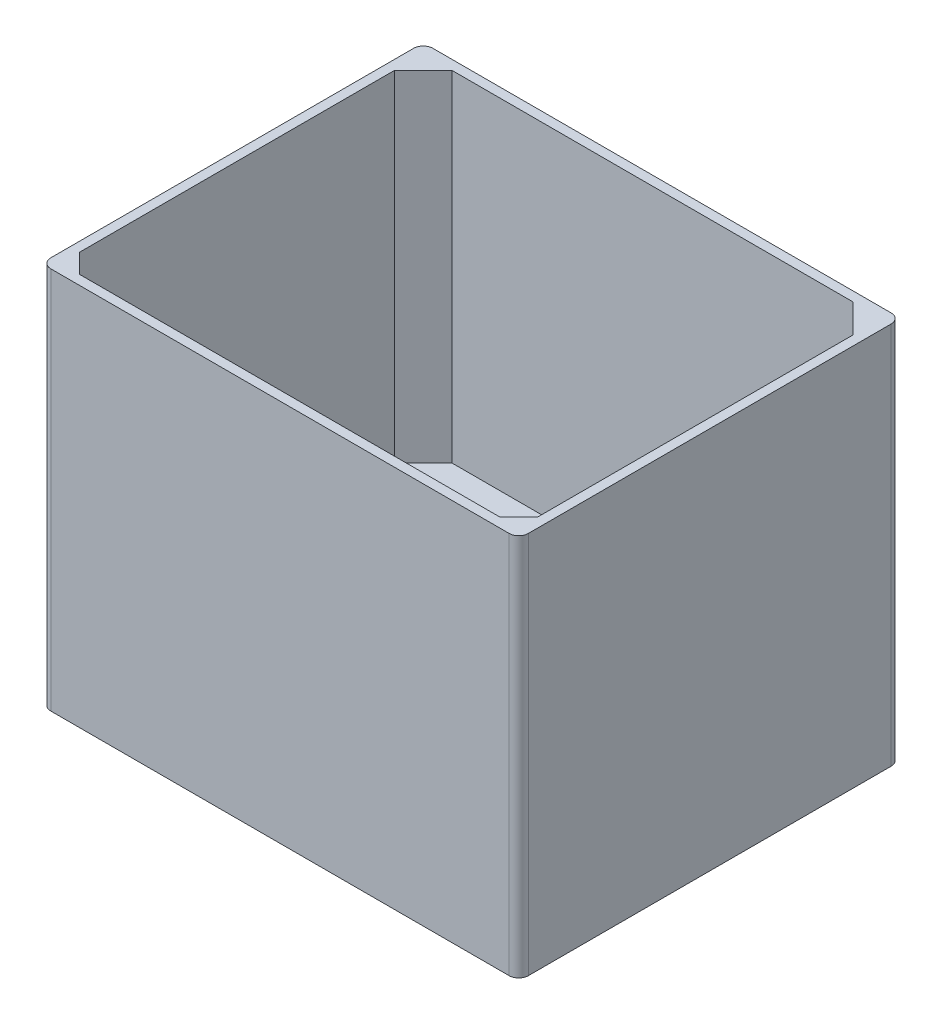
ISO-10303-21;
HEADER;
FILE_DESCRIPTION(('STEP AP214'),'2;1');
FILE_NAME('part.step','',(''),(''),'','','');
FILE_SCHEMA(('AUTOMOTIVE_DESIGN { 1 0 10303 214 1 1 1 1 }'));
ENDSEC;
DATA;
#1=APPLICATION_CONTEXT('core data for automotive mechanical design processes');
#2=APPLICATION_PROTOCOL_DEFINITION('international standard','automotive_design',2000,#1);
#3=PRODUCT_CONTEXT('',#1,'mechanical');
#4=PRODUCT('Part','Part','',(#3));
#5=PRODUCT_RELATED_PRODUCT_CATEGORY('part','',(#4));
#6=PRODUCT_DEFINITION_FORMATION('','',#4);
#7=PRODUCT_DEFINITION_CONTEXT('part definition',#1,'design');
#8=PRODUCT_DEFINITION('design','',#6,#7);
#9=PRODUCT_DEFINITION_SHAPE('','',#8);
#10=(LENGTH_UNIT() NAMED_UNIT(*) SI_UNIT(.MILLI.,.METRE.));
#11=(NAMED_UNIT(*) PLANE_ANGLE_UNIT() SI_UNIT($,.RADIAN.));
#12=(NAMED_UNIT(*) SI_UNIT($,.STERADIAN.) SOLID_ANGLE_UNIT());
#13=UNCERTAINTY_MEASURE_WITH_UNIT(LENGTH_MEASURE(1.E-05),#10,'distance_accuracy_value','');
#14=(GEOMETRIC_REPRESENTATION_CONTEXT(3) GLOBAL_UNCERTAINTY_ASSIGNED_CONTEXT((#13)) GLOBAL_UNIT_ASSIGNED_CONTEXT((#10,
#11,#12)) REPRESENTATION_CONTEXT('',''));
#15=CARTESIAN_POINT('',(0.,0.,0.));
#16=DIRECTION('',(0.,0.,1.));
#17=DIRECTION('',(1.,0.,0.));
#18=AXIS2_PLACEMENT_3D('',#15,#16,#17);
#19=CARTESIAN_POINT('',(9.07407407407408,-99.7824280830745,1.16315046698049));
#20=DIRECTION('',(0.,0.,-1.));
#21=DIRECTION('',(-1.,0.,0.));
#22=AXIS2_PLACEMENT_3D('',#19,#20,#21);
#23=PLANE('',#22);
#24=DIRECTION('',(-1.,0.,0.));
#25=VECTOR('',#24,1.);
#26=CARTESIAN_POINT('',(9.07407407407408,1.,1.16315046698049));
#27=LINE('',#26,#25);
#28=CARTESIAN_POINT('',(46.8438331280528,1.,1.16315046698049));
#29=VERTEX_POINT('',#28);
#30=CARTESIAN_POINT('',(-28.6539944588389,1.,1.16315046698049));
#31=VERTEX_POINT('',#30);
#32=EDGE_CURVE('E70',#29,#31,#27,.T.);
#33=ORIENTED_EDGE('',*,*,#32,.F.);
#34=DIRECTION('',(0.,1.,0.));
#35=VECTOR('',#34,1.);
#36=CARTESIAN_POINT('',(46.8438331280528,-99.7824280830745,1.16315046698049));
#37=LINE('',#36,#35);
#38=CARTESIAN_POINT('',(46.8438331280528,8.99999999999999,1.16315046698049));
#39=VERTEX_POINT('',#38);
#40=EDGE_CURVE('E267',#29,#39,#37,.T.);
#41=ORIENTED_EDGE('',*,*,#40,.T.);
#42=DIRECTION('',(-1.,0.,0.));
#43=VECTOR('',#42,1.);
#44=CARTESIAN_POINT('',(0.,9.,1.16315046698049));
#45=LINE('',#44,#43);
#46=CARTESIAN_POINT('',(-28.6539944588389,9.,1.16315046698049));
#47=VERTEX_POINT('',#46);
#48=EDGE_CURVE('E348',#39,#47,#45,.T.);
#49=ORIENTED_EDGE('',*,*,#48,.T.);
#50=DIRECTION('',(0.,1.,0.));
#51=VECTOR('',#50,1.);
#52=CARTESIAN_POINT('',(-28.6539944588389,-99.7824280830745,1.16315046698049));
#53=LINE('',#52,#51);
#54=EDGE_CURVE('E266',#31,#47,#53,.T.);
#55=ORIENTED_EDGE('',*,*,#54,.F.);
#56=EDGE_LOOP('',(#33,#41,#49,#55));
#57=FACE_BOUND('',#56,.T.);
#58=ADVANCED_FACE('F46',(#57),#23,.F.);
#59=CARTESIAN_POINT('',(46.8438331280528,-99.7824280830745,1.16315046698049));
#60=DIRECTION('',(1.,0.,0.));
#61=DIRECTION('',(0.,0.,-1.));
#62=AXIS2_PLACEMENT_3D('',#59,#60,#61);
#63=PLANE('',#62);
#64=DIRECTION('',(0.,0.,-1.));
#65=VECTOR('',#64,1.);
#66=CARTESIAN_POINT('',(46.8438331280528,1.,1.16315046698049));
#67=LINE('',#66,#65);
#68=CARTESIAN_POINT('',(46.8438331280528,1.,42.7586829855372));
#69=VERTEX_POINT('',#68);
#70=EDGE_CURVE('E261',#69,#29,#67,.T.);
#71=ORIENTED_EDGE('',*,*,#70,.F.);
#72=DIRECTION('',(0.,1.,0.));
#73=VECTOR('',#72,1.);
#74=CARTESIAN_POINT('',(46.8438331280528,-99.7824280830745,42.7586829855372));
#75=LINE('',#74,#73);
#76=CARTESIAN_POINT('',(46.8438331280528,8.99999999999999,42.7586829855372));
#77=VERTEX_POINT('',#76);
#78=EDGE_CURVE('E271',#69,#77,#75,.T.);
#79=ORIENTED_EDGE('',*,*,#78,.T.);
#80=DIRECTION('',(0.,0.,-1.));
#81=VECTOR('',#80,1.);
#82=CARTESIAN_POINT('',(46.8438331280528,9.,0.));
#83=LINE('',#82,#81);
#84=EDGE_CURVE('E344',#77,#39,#83,.T.);
#85=ORIENTED_EDGE('',*,*,#84,.T.);
#86=ORIENTED_EDGE('',*,*,#40,.F.);
#87=EDGE_LOOP('',(#71,#79,#85,#86));
#88=FACE_BOUND('',#87,.T.);
#89=ADVANCED_FACE('F507',(#88),#63,.F.);
#90=CARTESIAN_POINT('',(46.8438331280528,-99.7824280830745,42.7586829855372));
#91=DIRECTION('',(0.,0.,1.));
#92=DIRECTION('',(1.,0.,0.));
#93=AXIS2_PLACEMENT_3D('',#90,#91,#92);
#94=PLANE('',#93);
#95=DIRECTION('',(1.,0.,0.));
#96=VECTOR('',#95,1.);
#97=CARTESIAN_POINT('',(46.8438331280528,1.,42.7586829855372));
#98=LINE('',#97,#96);
#99=CARTESIAN_POINT('',(-28.6539944588389,1.,42.7586829855372));
#100=VERTEX_POINT('',#99);
#101=EDGE_CURVE('E253',#100,#69,#98,.T.);
#102=ORIENTED_EDGE('',*,*,#101,.F.);
#103=DIRECTION('',(0.,1.,0.));
#104=VECTOR('',#103,1.);
#105=CARTESIAN_POINT('',(-28.6539944588389,-99.7824280830745,42.7586829855372));
#106=LINE('',#105,#104);
#107=CARTESIAN_POINT('',(-28.6539944588389,8.99999999999999,42.7586829855372));
#108=VERTEX_POINT('',#107);
#109=EDGE_CURVE('E274',#100,#108,#106,.T.);
#110=ORIENTED_EDGE('',*,*,#109,.T.);
#111=DIRECTION('',(1.,0.,0.));
#112=VECTOR('',#111,1.);
#113=CARTESIAN_POINT('',(0.,9.,42.7586829855372));
#114=LINE('',#113,#112);
#115=EDGE_CURVE('E340',#108,#77,#114,.T.);
#116=ORIENTED_EDGE('',*,*,#115,.T.);
#117=ORIENTED_EDGE('',*,*,#78,.F.);
#118=EDGE_LOOP('',(#102,#110,#116,#117));
#119=FACE_BOUND('',#118,.T.);
#120=ADVANCED_FACE('F514',(#119),#94,.F.);
#121=CARTESIAN_POINT('',(-28.6539944588389,-99.7824280830745,42.7586829855372));
#122=DIRECTION('',(-1.,0.,0.));
#123=DIRECTION('',(0.,0.,1.));
#124=AXIS2_PLACEMENT_3D('',#121,#122,#123);
#125=PLANE('',#124);
#126=DIRECTION('',(0.,0.,1.));
#127=VECTOR('',#126,1.);
#128=CARTESIAN_POINT('',(-28.6539944588389,1.,42.7586829855372));
#129=LINE('',#128,#127);
#130=EDGE_CURVE('E11',#31,#100,#129,.T.);
#131=ORIENTED_EDGE('',*,*,#130,.F.);
#132=ORIENTED_EDGE('',*,*,#54,.T.);
#133=DIRECTION('',(0.,0.,1.));
#134=VECTOR('',#133,1.);
#135=CARTESIAN_POINT('',(-28.6539944588389,9.,0.));
#136=LINE('',#135,#134);
#137=EDGE_CURVE('E323',#47,#108,#136,.T.);
#138=ORIENTED_EDGE('',*,*,#137,.T.);
#139=ORIENTED_EDGE('',*,*,#109,.F.);
#140=EDGE_LOOP('',(#131,#132,#138,#139));
#141=FACE_BOUND('',#140,.T.);
#142=ADVANCED_FACE('F522',(#141),#125,.F.);
#143=CARTESIAN_POINT('',(-40.9259259259259,80.2175719169256,-33.4259259259259));
#144=DIRECTION('',(1.,0.,0.));
#145=DIRECTION('',(0.,0.,-1.));
#146=AXIS2_PLACEMENT_3D('',#143,#144,#145);
#147=PLANE('',#146);
#148=DIRECTION('',(0.,0.,1.));
#149=VECTOR('',#148,1.);
#150=CARTESIAN_POINT('',(-40.9259259259259,80.2175719169256,-33.4259259259259));
#151=LINE('',#150,#149);
#152=CARTESIAN_POINT('',(-40.9259259259259,80.2175719169256,-31.4259259259259));
#153=VERTEX_POINT('',#152);
#154=CARTESIAN_POINT('',(-40.9259259259259,80.2175719169256,44.5740740740741));
#155=VERTEX_POINT('',#154);
#156=EDGE_CURVE('E307',#153,#155,#151,.T.);
#157=ORIENTED_EDGE('',*,*,#156,.F.);
#158=DIRECTION('',(0.,-1.,0.));
#159=VECTOR('',#158,1.);
#160=CARTESIAN_POINT('',(-40.9259259259259,80.2175719169256,-31.4259259259259));
#161=LINE('',#160,#159);
#162=CARTESIAN_POINT('',(-40.9259259259259,0.,-31.4259259259259));
#163=VERTEX_POINT('',#162);
#164=EDGE_CURVE('E367',#153,#163,#161,.T.);
#165=ORIENTED_EDGE('',*,*,#164,.T.);
#166=DIRECTION('',(0.,0.,1.));
#167=VECTOR('',#166,1.);
#168=CARTESIAN_POINT('',(-40.9259259259259,0.,-33.4259259259259));
#169=LINE('',#168,#167);
#170=CARTESIAN_POINT('',(-40.9259259259259,0.,44.5740740740741));
#171=VERTEX_POINT('',#170);
#172=EDGE_CURVE('E306',#163,#171,#169,.T.);
#173=ORIENTED_EDGE('',*,*,#172,.T.);
#174=DIRECTION('',(0.,-1.,0.));
#175=VECTOR('',#174,1.);
#176=CARTESIAN_POINT('',(-40.9259259259259,80.2175719169256,44.5740740740741));
#177=LINE('',#176,#175);
#178=EDGE_CURVE('E360',#171,#155,#177,.F.);
#179=ORIENTED_EDGE('',*,*,#178,.T.);
#180=EDGE_LOOP('',(#157,#165,#173,#179));
#181=FACE_BOUND('',#180,.T.);
#182=ADVANCED_FACE('F526',(#181),#147,.F.);
#183=CARTESIAN_POINT('',(-40.9259259259259,80.2175719169256,46.5740740740741));
#184=DIRECTION('',(0.,0.,-1.));
#185=DIRECTION('',(-1.,0.,0.));
#186=AXIS2_PLACEMENT_3D('',#183,#184,#185);
#187=PLANE('',#186);
#188=DIRECTION('',(1.,0.,0.));
#189=VECTOR('',#188,1.);
#190=CARTESIAN_POINT('',(-40.9259259259259,0.,46.5740740740741));
#191=LINE('',#190,#189);
#192=CARTESIAN_POINT('',(-38.9259259259259,0.,46.5740740740741));
#193=VERTEX_POINT('',#192);
#194=CARTESIAN_POINT('',(57.0740740740741,0.,46.5740740740741));
#195=VERTEX_POINT('',#194);
#196=EDGE_CURVE('E326',#193,#195,#191,.T.);
#197=ORIENTED_EDGE('',*,*,#196,.T.);
#198=DIRECTION('',(0.,-1.,0.));
#199=VECTOR('',#198,1.);
#200=CARTESIAN_POINT('',(57.0740740740741,80.2175719169256,46.5740740740741));
#201=LINE('',#200,#199);
#202=CARTESIAN_POINT('',(57.0740740740741,80.2175719169256,46.5740740740741));
#203=VERTEX_POINT('',#202);
#204=EDGE_CURVE('E403',#195,#203,#201,.F.);
#205=ORIENTED_EDGE('',*,*,#204,.T.);
#206=DIRECTION('',(1.,0.,0.));
#207=VECTOR('',#206,1.);
#208=CARTESIAN_POINT('',(-40.9259259259259,80.2175719169256,46.5740740740741));
#209=LINE('',#208,#207);
#210=CARTESIAN_POINT('',(-38.9259259259259,80.2175719169256,46.5740740740741));
#211=VERTEX_POINT('',#210);
#212=EDGE_CURVE('E310',#211,#203,#209,.T.);
#213=ORIENTED_EDGE('',*,*,#212,.F.);
#214=DIRECTION('',(0.,-1.,0.));
#215=VECTOR('',#214,1.);
#216=CARTESIAN_POINT('',(-38.9259259259259,80.2175719169256,46.5740740740741));
#217=LINE('',#216,#215);
#218=EDGE_CURVE('E352',#211,#193,#217,.T.);
#219=ORIENTED_EDGE('',*,*,#218,.T.);
#220=EDGE_LOOP('',(#197,#205,#213,#219));
#221=FACE_BOUND('',#220,.T.);
#222=ADVANCED_FACE('F553',(#221),#187,.F.);
#223=CARTESIAN_POINT('',(59.0740740740741,80.2175719169256,-33.4259259259259));
#224=DIRECTION('',(-1.,0.,0.));
#225=DIRECTION('',(0.,0.,1.));
#226=AXIS2_PLACEMENT_3D('',#223,#224,#225);
#227=PLANE('',#226);
#228=DIRECTION('',(0.,0.,-1.));
#229=VECTOR('',#228,1.);
#230=CARTESIAN_POINT('',(59.0740740740741,0.,-33.4259259259259));
#231=LINE('',#230,#229);
#232=CARTESIAN_POINT('',(59.0740740740741,0.,44.5740740740741));
#233=VERTEX_POINT('',#232);
#234=CARTESIAN_POINT('',(59.0740740740741,0.,-31.4259259259259));
#235=VERTEX_POINT('',#234);
#236=EDGE_CURVE('E330',#233,#235,#231,.T.);
#237=ORIENTED_EDGE('',*,*,#236,.T.);
#238=DIRECTION('',(0.,-1.,0.));
#239=VECTOR('',#238,1.);
#240=CARTESIAN_POINT('',(59.0740740740741,80.2175719169256,-31.4259259259259));
#241=LINE('',#240,#239);
#242=CARTESIAN_POINT('',(59.0740740740741,80.2175719169256,-31.4259259259259));
#243=VERTEX_POINT('',#242);
#244=EDGE_CURVE('E400',#235,#243,#241,.F.);
#245=ORIENTED_EDGE('',*,*,#244,.T.);
#246=DIRECTION('',(0.,0.,-1.));
#247=VECTOR('',#246,1.);
#248=CARTESIAN_POINT('',(59.0740740740741,80.2175719169256,-33.4259259259259));
#249=LINE('',#248,#247);
#250=CARTESIAN_POINT('',(59.0740740740741,80.2175719169256,44.5740740740741));
#251=VERTEX_POINT('',#250);
#252=EDGE_CURVE('E315',#251,#243,#249,.T.);
#253=ORIENTED_EDGE('',*,*,#252,.F.);
#254=DIRECTION('',(0.,-1.,0.));
#255=VECTOR('',#254,1.);
#256=CARTESIAN_POINT('',(59.0740740740741,80.2175719169256,44.5740740740741));
#257=LINE('',#256,#255);
#258=EDGE_CURVE('E396',#251,#233,#257,.T.);
#259=ORIENTED_EDGE('',*,*,#258,.T.);
#260=EDGE_LOOP('',(#237,#245,#253,#259));
#261=FACE_BOUND('',#260,.T.);
#262=ADVANCED_FACE('F549',(#261),#227,.F.);
#263=CARTESIAN_POINT('',(-40.9259259259259,80.2175719169256,-33.4259259259259));
#264=DIRECTION('',(0.,0.,1.));
#265=DIRECTION('',(1.,0.,0.));
#266=AXIS2_PLACEMENT_3D('',#263,#264,#265);
#267=PLANE('',#266);
#268=DIRECTION('',(-1.,0.,0.));
#269=VECTOR('',#268,1.);
#270=CARTESIAN_POINT('',(-40.9259259259259,0.,-33.4259259259259));
#271=LINE('',#270,#269);
#272=CARTESIAN_POINT('',(57.0740740740741,0.,-33.4259259259259));
#273=VERTEX_POINT('',#272);
#274=CARTESIAN_POINT('',(-38.9259259259259,0.,-33.4259259259259));
#275=VERTEX_POINT('',#274);
#276=EDGE_CURVE('E311',#273,#275,#271,.T.);
#277=ORIENTED_EDGE('',*,*,#276,.T.);
#278=DIRECTION('',(0.,-1.,0.));
#279=VECTOR('',#278,1.);
#280=CARTESIAN_POINT('',(-38.9259259259259,80.2175719169256,-33.4259259259259));
#281=LINE('',#280,#279);
#282=CARTESIAN_POINT('',(-38.9259259259259,80.2175719169256,-33.4259259259259));
#283=VERTEX_POINT('',#282);
#284=EDGE_CURVE('E384',#275,#283,#281,.F.);
#285=ORIENTED_EDGE('',*,*,#284,.T.);
#286=DIRECTION('',(-1.,0.,0.));
#287=VECTOR('',#286,1.);
#288=CARTESIAN_POINT('',(-40.9259259259259,80.2175719169256,-33.4259259259259));
#289=LINE('',#288,#287);
#290=CARTESIAN_POINT('',(57.0740740740741,80.2175719169256,-33.4259259259259));
#291=VERTEX_POINT('',#290);
#292=EDGE_CURVE('E319',#291,#283,#289,.T.);
#293=ORIENTED_EDGE('',*,*,#292,.F.);
#294=DIRECTION('',(0.,-1.,0.));
#295=VECTOR('',#294,1.);
#296=CARTESIAN_POINT('',(57.0740740740741,80.2175719169256,-33.4259259259259));
#297=LINE('',#296,#295);
#298=EDGE_CURVE('E380',#291,#273,#297,.T.);
#299=ORIENTED_EDGE('',*,*,#298,.T.);
#300=EDGE_LOOP('',(#277,#285,#293,#299));
#301=FACE_BOUND('',#300,.T.);
#302=ADVANCED_FACE('F543',(#301),#267,.F.);
#303=CARTESIAN_POINT('',(0.,80.2175719169256,0.));
#304=DIRECTION('',(0.,1.,0.));
#305=DIRECTION('',(0.,0.,1.));
#306=AXIS2_PLACEMENT_3D('',#303,#304,#305);
#307=PLANE('',#306);
#308=DIRECTION('',(0.,0.,1.));
#309=VECTOR('',#308,1.);
#310=CARTESIAN_POINT('',(-38.9259259259259,80.2175719169256,-33.4259259259259));
#311=LINE('',#310,#309);
#312=CARTESIAN_POINT('',(-38.9259259259259,80.2175719169256,-25.425925925926));
#313=VERTEX_POINT('',#312);
#314=CARTESIAN_POINT('',(-38.9259259259259,80.2175719169256,40.574074074074));
#315=VERTEX_POINT('',#314);
#316=EDGE_CURVE('E292',#313,#315,#311,.T.);
#317=ORIENTED_EDGE('',*,*,#316,.F.);
#318=DIRECTION('',(-0.707106781186551,0.,0.707106781186544));
#319=VECTOR('',#318,1.);
#320=CARTESIAN_POINT('',(-32.9259259259259,80.2175719169256,-31.4259259259259));
#321=LINE('',#320,#319);
#322=CARTESIAN_POINT('',(-32.9259259259259,80.2175719169256,-31.4259259259259));
#323=VERTEX_POINT('',#322);
#324=EDGE_CURVE('E416',#313,#323,#321,.F.);
#325=ORIENTED_EDGE('',*,*,#324,.T.);
#326=DIRECTION('',(-1.,0.,0.));
#327=VECTOR('',#326,1.);
#328=CARTESIAN_POINT('',(-40.9259259259259,80.2175719169256,-31.4259259259259));
#329=LINE('',#328,#327);
#330=CARTESIAN_POINT('',(51.0740740740741,80.2175719169256,-31.4259259259259));
#331=VERTEX_POINT('',#330);
#332=EDGE_CURVE('E303',#331,#323,#329,.T.);
#333=ORIENTED_EDGE('',*,*,#332,.F.);
#334=DIRECTION('',(-0.707106781186545,0.,-0.70710678118655));
#335=VECTOR('',#334,1.);
#336=CARTESIAN_POINT('',(57.0740740740741,80.2175719169256,-25.4259259259259));
#337=LINE('',#336,#335);
#338=CARTESIAN_POINT('',(57.0740740740741,80.2175719169256,-25.4259259259259));
#339=VERTEX_POINT('',#338);
#340=EDGE_CURVE('E430',#331,#339,#337,.F.);
#341=ORIENTED_EDGE('',*,*,#340,.T.);
#342=DIRECTION('',(0.,0.,-1.));
#343=VECTOR('',#342,1.);
#344=CARTESIAN_POINT('',(57.0740740740741,80.2175719169256,-33.4259259259259));
#345=LINE('',#344,#343);
#346=CARTESIAN_POINT('',(57.0740740740741,80.2175719169256,40.5740740740741));
#347=VERTEX_POINT('',#346);
#348=EDGE_CURVE('E300',#347,#339,#345,.T.);
#349=ORIENTED_EDGE('',*,*,#348,.F.);
#350=DIRECTION('',(0.707106781186552,0.,-0.707106781186543));
#351=VECTOR('',#350,1.);
#352=CARTESIAN_POINT('',(53.074074074074,80.2175719169256,44.5740740740741));
#353=LINE('',#352,#351);
#354=CARTESIAN_POINT('',(53.074074074074,80.2175719169256,44.5740740740741));
#355=VERTEX_POINT('',#354);
#356=EDGE_CURVE('E56',#347,#355,#353,.F.);
#357=ORIENTED_EDGE('',*,*,#356,.T.);
#358=DIRECTION('',(1.,0.,0.));
#359=VECTOR('',#358,1.);
#360=CARTESIAN_POINT('',(-40.9259259259259,80.2175719169256,44.5740740740741));
#361=LINE('',#360,#359);
#362=CARTESIAN_POINT('',(-34.9259259259259,80.2175719169256,44.5740740740741));
#363=VERTEX_POINT('',#362);
#364=EDGE_CURVE('E296',#363,#355,#361,.T.);
#365=ORIENTED_EDGE('',*,*,#364,.F.);
#366=DIRECTION('',(0.707106781186544,0.,0.707106781186551));
#367=VECTOR('',#366,1.);
#368=CARTESIAN_POINT('',(-38.9259259259259,80.2175719169256,40.574074074074));
#369=LINE('',#368,#367);
#370=EDGE_CURVE('E454',#363,#315,#369,.F.);
#371=ORIENTED_EDGE('',*,*,#370,.T.);
#372=EDGE_LOOP('',(#317,#325,#333,#341,#349,#357,#365,#371));
#373=FACE_BOUND('',#372,.T.);
#374=ORIENTED_EDGE('',*,*,#292,.T.);
#375=CARTESIAN_POINT('',(-38.9259259259259,80.2175719169256,-31.4259259259259));
#376=DIRECTION('',(0.,1.,0.));
#377=DIRECTION('',(0.,0.,1.));
#378=AXIS2_PLACEMENT_3D('',#375,#376,#377);
#379=CIRCLE('',#378,2.);
#380=EDGE_CURVE('E393',#283,#153,#379,.T.);
#381=ORIENTED_EDGE('',*,*,#380,.T.);
#382=ORIENTED_EDGE('',*,*,#156,.T.);
#383=CARTESIAN_POINT('',(-38.9259259259259,80.2175719169256,44.5740740740741));
#384=DIRECTION('',(0.,1.,0.));
#385=DIRECTION('',(0.,0.,1.));
#386=AXIS2_PLACEMENT_3D('',#383,#384,#385);
#387=CIRCLE('',#386,2.);
#388=EDGE_CURVE('E364',#155,#211,#387,.T.);
#389=ORIENTED_EDGE('',*,*,#388,.T.);
#390=ORIENTED_EDGE('',*,*,#212,.T.);
#391=CARTESIAN_POINT('',(57.0740740740741,80.2175719169256,44.5740740740741));
#392=DIRECTION('',(0.,1.,0.));
#393=DIRECTION('',(0.,0.,1.));
#394=AXIS2_PLACEMENT_3D('',#391,#392,#393);
#395=CIRCLE('',#394,2.);
#396=EDGE_CURVE('E387',#203,#251,#395,.T.);
#397=ORIENTED_EDGE('',*,*,#396,.T.);
#398=ORIENTED_EDGE('',*,*,#252,.T.);
#399=CARTESIAN_POINT('',(57.0740740740741,80.2175719169256,-31.4259259259259));
#400=DIRECTION('',(0.,1.,0.));
#401=DIRECTION('',(0.,0.,1.));
#402=AXIS2_PLACEMENT_3D('',#399,#400,#401);
#403=CIRCLE('',#402,2.);
#404=EDGE_CURVE('E390',#243,#291,#403,.T.);
#405=ORIENTED_EDGE('',*,*,#404,.T.);
#406=EDGE_LOOP('',(#374,#381,#382,#389,#390,#397,#398,#405));
#407=FACE_BOUND('',#406,.T.);
#408=ADVANCED_FACE('F462',(#373,#407),#307,.T.);
#409=CARTESIAN_POINT('',(0.,0.,0.));
#410=DIRECTION('',(0.,1.,0.));
#411=DIRECTION('',(0.,0.,1.));
#412=AXIS2_PLACEMENT_3D('',#409,#410,#411);
#413=PLANE('',#412);
#414=DIRECTION('',(1.,0.,0.));
#415=VECTOR('',#414,1.);
#416=CARTESIAN_POINT('',(-33.4167458702791,0.,-1.23514930794889));
#417=LINE('',#416,#415);
#418=CARTESIAN_POINT('',(-33.4167458702791,0.,-1.23514930794889));
#419=VERTEX_POINT('',#418);
#420=CARTESIAN_POINT('',(51.5832541297209,0.,-1.23514930794889));
#421=VERTEX_POINT('',#420);
#422=EDGE_CURVE('E244',#419,#421,#417,.T.);
#423=ORIENTED_EDGE('',*,*,#422,.F.);
#424=DIRECTION('',(0.,0.,-1.));
#425=VECTOR('',#424,1.);
#426=CARTESIAN_POINT('',(-33.4167458702791,0.,42.7648506920511));
#427=LINE('',#426,#425);
#428=CARTESIAN_POINT('',(-33.4167458702791,0.,42.7648506920511));
#429=VERTEX_POINT('',#428);
#430=EDGE_CURVE('E63',#429,#419,#427,.T.);
#431=ORIENTED_EDGE('',*,*,#430,.F.);
#432=DIRECTION('',(-1.,0.,0.));
#433=VECTOR('',#432,1.);
#434=CARTESIAN_POINT('',(-33.4167458702791,0.,42.7648506920511));
#435=LINE('',#434,#433);
#436=CARTESIAN_POINT('',(51.5832541297209,0.,42.7648506920511));
#437=VERTEX_POINT('',#436);
#438=EDGE_CURVE('E231',#437,#429,#435,.T.);
#439=ORIENTED_EDGE('',*,*,#438,.F.);
#440=DIRECTION('',(0.,0.,1.));
#441=VECTOR('',#440,1.);
#442=CARTESIAN_POINT('',(51.5832541297209,0.,42.7648506920511));
#443=LINE('',#442,#441);
#444=EDGE_CURVE('E235',#421,#437,#443,.T.);
#445=ORIENTED_EDGE('',*,*,#444,.F.);
#446=EDGE_LOOP('',(#423,#431,#439,#445));
#447=FACE_BOUND('',#446,.T.);
#448=ORIENTED_EDGE('',*,*,#172,.F.);
#449=CARTESIAN_POINT('',(-38.9259259259259,0.,-31.4259259259259));
#450=DIRECTION('',(0.,1.,0.));
#451=DIRECTION('',(0.,0.,1.));
#452=AXIS2_PLACEMENT_3D('',#449,#450,#451);
#453=CIRCLE('',#452,2.);
#454=EDGE_CURVE('E377',#163,#275,#453,.F.);
#455=ORIENTED_EDGE('',*,*,#454,.T.);
#456=ORIENTED_EDGE('',*,*,#276,.F.);
#457=CARTESIAN_POINT('',(57.0740740740741,0.,-31.4259259259259));
#458=DIRECTION('',(0.,1.,0.));
#459=DIRECTION('',(0.,0.,1.));
#460=AXIS2_PLACEMENT_3D('',#457,#458,#459);
#461=CIRCLE('',#460,2.);
#462=EDGE_CURVE('E374',#273,#235,#461,.F.);
#463=ORIENTED_EDGE('',*,*,#462,.T.);
#464=ORIENTED_EDGE('',*,*,#236,.F.);
#465=CARTESIAN_POINT('',(57.0740740740741,0.,44.5740740740741));
#466=DIRECTION('',(0.,1.,0.));
#467=DIRECTION('',(0.,0.,1.));
#468=AXIS2_PLACEMENT_3D('',#465,#466,#467);
#469=CIRCLE('',#468,2.);
#470=EDGE_CURVE('E371',#233,#195,#469,.F.);
#471=ORIENTED_EDGE('',*,*,#470,.T.);
#472=ORIENTED_EDGE('',*,*,#196,.F.);
#473=CARTESIAN_POINT('',(-38.9259259259259,0.,44.5740740740741));
#474=DIRECTION('',(0.,1.,0.));
#475=DIRECTION('',(0.,0.,1.));
#476=AXIS2_PLACEMENT_3D('',#473,#474,#475);
#477=CIRCLE('',#476,2.);
#478=EDGE_CURVE('E356',#193,#171,#477,.F.);
#479=ORIENTED_EDGE('',*,*,#478,.T.);
#480=EDGE_LOOP('',(#448,#455,#456,#463,#464,#471,#472,#479));
#481=FACE_BOUND('',#480,.T.);
#482=ADVANCED_FACE('F530',(#447,#481),#413,.F.);
#483=CARTESIAN_POINT('',(-38.9259259259259,80.2175719169256,-33.4259259259259));
#484=DIRECTION('',(1.,0.,0.));
#485=DIRECTION('',(0.,0.,-1.));
#486=AXIS2_PLACEMENT_3D('',#483,#484,#485);
#487=PLANE('',#486);
#488=ORIENTED_EDGE('',*,*,#316,.T.);
#489=DIRECTION('',(0.,-1.,0.));
#490=VECTOR('',#489,1.);
#491=CARTESIAN_POINT('',(-38.9259259259259,9.,40.574074074074));
#492=LINE('',#491,#490);
#493=CARTESIAN_POINT('',(-38.9259259259259,8.99999999999999,40.574074074074));
#494=VERTEX_POINT('',#493);
#495=EDGE_CURVE('E434',#315,#494,#492,.T.);
#496=ORIENTED_EDGE('',*,*,#495,.T.);
#497=DIRECTION('',(0.,0.,1.));
#498=VECTOR('',#497,1.);
#499=CARTESIAN_POINT('',(-38.9259259259259,8.99999999999999,-33.4259259259259));
#500=LINE('',#499,#498);
#501=CARTESIAN_POINT('',(-38.9259259259259,8.99999999999999,-25.425925925926));
#502=VERTEX_POINT('',#501);
#503=EDGE_CURVE('E270',#502,#494,#500,.T.);
#504=ORIENTED_EDGE('',*,*,#503,.F.);
#505=DIRECTION('',(0.,1.,0.));
#506=VECTOR('',#505,1.);
#507=CARTESIAN_POINT('',(-38.9259259259259,80.2175719169256,-25.425925925926));
#508=LINE('',#507,#506);
#509=EDGE_CURVE('E413',#502,#313,#508,.T.);
#510=ORIENTED_EDGE('',*,*,#509,.T.);
#511=EDGE_LOOP('',(#488,#496,#504,#510));
#512=FACE_BOUND('',#511,.T.);
#513=ADVANCED_FACE('F495',(#512),#487,.T.);
#514=CARTESIAN_POINT('',(-40.9259259259259,80.2175719169256,44.5740740740741));
#515=DIRECTION('',(0.,0.,-1.));
#516=DIRECTION('',(-1.,0.,0.));
#517=AXIS2_PLACEMENT_3D('',#514,#515,#516);
#518=PLANE('',#517);
#519=DIRECTION('',(1.,0.,0.));
#520=VECTOR('',#519,1.);
#521=CARTESIAN_POINT('',(-40.9259259259259,8.99999999999999,44.5740740740741));
#522=LINE('',#521,#520);
#523=CARTESIAN_POINT('',(-34.9259259259259,8.99999999999999,44.5740740740741));
#524=VERTEX_POINT('',#523);
#525=CARTESIAN_POINT('',(53.074074074074,8.99999999999999,44.5740740740741));
#526=VERTEX_POINT('',#525);
#527=EDGE_CURVE('E282',#524,#526,#522,.T.);
#528=ORIENTED_EDGE('',*,*,#527,.F.);
#529=DIRECTION('',(0.,1.,0.));
#530=VECTOR('',#529,1.);
#531=CARTESIAN_POINT('',(-34.9259259259259,80.2175719169256,44.5740740740741));
#532=LINE('',#531,#530);
#533=EDGE_CURVE('E448',#524,#363,#532,.T.);
#534=ORIENTED_EDGE('',*,*,#533,.T.);
#535=ORIENTED_EDGE('',*,*,#364,.T.);
#536=DIRECTION('',(0.,-1.,0.));
#537=VECTOR('',#536,1.);
#538=CARTESIAN_POINT('',(53.074074074074,9.,44.5740740740741));
#539=LINE('',#538,#537);
#540=EDGE_CURVE('E444',#355,#526,#539,.T.);
#541=ORIENTED_EDGE('',*,*,#540,.T.);
#542=EDGE_LOOP('',(#528,#534,#535,#541));
#543=FACE_BOUND('',#542,.T.);
#544=ADVANCED_FACE('F470',(#543),#518,.T.);
#545=CARTESIAN_POINT('',(57.0740740740741,80.2175719169256,-33.4259259259259));
#546=DIRECTION('',(-1.,0.,0.));
#547=DIRECTION('',(0.,0.,1.));
#548=AXIS2_PLACEMENT_3D('',#545,#546,#547);
#549=PLANE('',#548);
#550=DIRECTION('',(0.,0.,-1.));
#551=VECTOR('',#550,1.);
#552=CARTESIAN_POINT('',(57.0740740740741,8.99999999999999,-33.4259259259259));
#553=LINE('',#552,#551);
#554=CARTESIAN_POINT('',(57.0740740740741,8.99999999999999,40.5740740740741));
#555=VERTEX_POINT('',#554);
#556=CARTESIAN_POINT('',(57.0740740740741,8.99999999999999,-25.4259259259259));
#557=VERTEX_POINT('',#556);
#558=EDGE_CURVE('E286',#555,#557,#553,.T.);
#559=ORIENTED_EDGE('',*,*,#558,.F.);
#560=DIRECTION('',(0.,1.,0.));
#561=VECTOR('',#560,1.);
#562=CARTESIAN_POINT('',(57.0740740740741,80.2175719169256,40.5740740740741));
#563=LINE('',#562,#561);
#564=EDGE_CURVE('E451',#555,#347,#563,.T.);
#565=ORIENTED_EDGE('',*,*,#564,.T.);
#566=ORIENTED_EDGE('',*,*,#348,.T.);
#567=DIRECTION('',(0.,-1.,0.));
#568=VECTOR('',#567,1.);
#569=CARTESIAN_POINT('',(57.0740740740741,9.,-25.4259259259259));
#570=LINE('',#569,#568);
#571=EDGE_CURVE('E420',#339,#557,#570,.T.);
#572=ORIENTED_EDGE('',*,*,#571,.T.);
#573=EDGE_LOOP('',(#559,#565,#566,#572));
#574=FACE_BOUND('',#573,.T.);
#575=ADVANCED_FACE('F477',(#574),#549,.T.);
#576=CARTESIAN_POINT('',(-40.9259259259259,80.2175719169256,-31.4259259259259));
#577=DIRECTION('',(0.,0.,1.));
#578=DIRECTION('',(1.,0.,0.));
#579=AXIS2_PLACEMENT_3D('',#576,#577,#578);
#580=PLANE('',#579);
#581=DIRECTION('',(-1.,0.,0.));
#582=VECTOR('',#581,1.);
#583=CARTESIAN_POINT('',(-40.9259259259259,8.99999999999999,-31.4259259259259));
#584=LINE('',#583,#582);
#585=CARTESIAN_POINT('',(51.0740740740741,8.99999999999999,-31.4259259259259));
#586=VERTEX_POINT('',#585);
#587=CARTESIAN_POINT('',(-32.9259259259259,8.99999999999999,-31.4259259259259));
#588=VERTEX_POINT('',#587);
#589=EDGE_CURVE('E289',#586,#588,#584,.T.);
#590=ORIENTED_EDGE('',*,*,#589,.F.);
#591=DIRECTION('',(0.,1.,0.));
#592=VECTOR('',#591,1.);
#593=CARTESIAN_POINT('',(51.0740740740741,80.2175719169256,-31.4259259259259));
#594=LINE('',#593,#592);
#595=EDGE_CURVE('E427',#586,#331,#594,.T.);
#596=ORIENTED_EDGE('',*,*,#595,.T.);
#597=ORIENTED_EDGE('',*,*,#332,.T.);
#598=DIRECTION('',(0.,-1.,0.));
#599=VECTOR('',#598,1.);
#600=CARTESIAN_POINT('',(-32.9259259259259,9.,-31.4259259259259));
#601=LINE('',#600,#599);
#602=EDGE_CURVE('E406',#323,#588,#601,.T.);
#603=ORIENTED_EDGE('',*,*,#602,.T.);
#604=EDGE_LOOP('',(#590,#596,#597,#603));
#605=FACE_BOUND('',#604,.T.);
#606=ADVANCED_FACE('F486',(#605),#580,.T.);
#607=CARTESIAN_POINT('',(0.,9.,0.));
#608=DIRECTION('',(0.,1.,0.));
#609=DIRECTION('',(0.,0.,1.));
#610=AXIS2_PLACEMENT_3D('',#607,#608,#609);
#611=PLANE('',#610);
#612=ORIENTED_EDGE('',*,*,#48,.F.);
#613=ORIENTED_EDGE('',*,*,#84,.F.);
#614=ORIENTED_EDGE('',*,*,#115,.F.);
#615=ORIENTED_EDGE('',*,*,#137,.F.);
#616=EDGE_LOOP('',(#612,#613,#614,#615));
#617=FACE_BOUND('',#616,.T.);
#618=ORIENTED_EDGE('',*,*,#503,.T.);
#619=DIRECTION('',(-0.707106781186544,0.,-0.707106781186551));
#620=VECTOR('',#619,1.);
#621=CARTESIAN_POINT('',(-39.7500000000002,9.,39.7499999999998));
#622=LINE('',#621,#620);
#623=EDGE_CURVE('E441',#494,#524,#622,.F.);
#624=ORIENTED_EDGE('',*,*,#623,.T.);
#625=ORIENTED_EDGE('',*,*,#527,.T.);
#626=DIRECTION('',(-0.707106781186552,0.,0.707106781186543));
#627=VECTOR('',#626,1.);
#628=CARTESIAN_POINT('',(48.8240740740737,9.,48.8240740740743));
#629=LINE('',#628,#627);
#630=EDGE_CURVE('E438',#526,#555,#629,.F.);
#631=ORIENTED_EDGE('',*,*,#630,.T.);
#632=ORIENTED_EDGE('',*,*,#558,.T.);
#633=DIRECTION('',(0.707106781186545,0.,0.70710678118655));
#634=VECTOR('',#633,1.);
#635=CARTESIAN_POINT('',(41.2500000000002,9.,-41.2499999999999));
#636=LINE('',#635,#634);
#637=EDGE_CURVE('E424',#557,#586,#636,.F.);
#638=ORIENTED_EDGE('',*,*,#637,.T.);
#639=ORIENTED_EDGE('',*,*,#589,.T.);
#640=DIRECTION('',(0.707106781186551,0.,-0.707106781186544));
#641=VECTOR('',#640,1.);
#642=CARTESIAN_POINT('',(-32.1759259259258,9.,-32.1759259259261));
#643=LINE('',#642,#641);
#644=EDGE_CURVE('E410',#588,#502,#643,.F.);
#645=ORIENTED_EDGE('',*,*,#644,.T.);
#646=EDGE_LOOP('',(#618,#624,#625,#631,#632,#638,#639,#645));
#647=FACE_BOUND('',#646,.T.);
#648=ADVANCED_FACE('F474',(#617,#647),#611,.T.);
#649=CARTESIAN_POINT('',(-38.9259259259259,80.2175719169256,44.5740740740741));
#650=DIRECTION('',(0.,-1.,0.));
#651=DIRECTION('',(0.,0.,-1.));
#652=AXIS2_PLACEMENT_3D('',#649,#650,#651);
#653=CYLINDRICAL_SURFACE('',#652,2.);
#654=ORIENTED_EDGE('',*,*,#388,.F.);
#655=ORIENTED_EDGE('',*,*,#178,.F.);
#656=ORIENTED_EDGE('',*,*,#478,.F.);
#657=ORIENTED_EDGE('',*,*,#218,.F.);
#658=EDGE_LOOP('',(#654,#655,#656,#657));
#659=FACE_BOUND('',#658,.T.);
#660=ADVANCED_FACE('F539',(#659),#653,.T.);
#661=CARTESIAN_POINT('',(-38.9259259259259,80.2175719169256,-31.4259259259259));
#662=DIRECTION('',(0.,-1.,0.));
#663=DIRECTION('',(0.,0.,-1.));
#664=AXIS2_PLACEMENT_3D('',#661,#662,#663);
#665=CYLINDRICAL_SURFACE('',#664,2.);
#666=ORIENTED_EDGE('',*,*,#380,.F.);
#667=ORIENTED_EDGE('',*,*,#284,.F.);
#668=ORIENTED_EDGE('',*,*,#454,.F.);
#669=ORIENTED_EDGE('',*,*,#164,.F.);
#670=EDGE_LOOP('',(#666,#667,#668,#669));
#671=FACE_BOUND('',#670,.T.);
#672=ADVANCED_FACE('F563',(#671),#665,.T.);
#673=CARTESIAN_POINT('',(57.0740740740741,80.2175719169256,-31.4259259259259));
#674=DIRECTION('',(0.,-1.,0.));
#675=DIRECTION('',(0.,0.,-1.));
#676=AXIS2_PLACEMENT_3D('',#673,#674,#675);
#677=CYLINDRICAL_SURFACE('',#676,2.);
#678=ORIENTED_EDGE('',*,*,#404,.F.);
#679=ORIENTED_EDGE('',*,*,#244,.F.);
#680=ORIENTED_EDGE('',*,*,#462,.F.);
#681=ORIENTED_EDGE('',*,*,#298,.F.);
#682=EDGE_LOOP('',(#678,#679,#680,#681));
#683=FACE_BOUND('',#682,.T.);
#684=ADVANCED_FACE('F567',(#683),#677,.T.);
#685=CARTESIAN_POINT('',(57.0740740740741,80.2175719169256,44.5740740740741));
#686=DIRECTION('',(0.,-1.,0.));
#687=DIRECTION('',(0.,0.,-1.));
#688=AXIS2_PLACEMENT_3D('',#685,#686,#687);
#689=CYLINDRICAL_SURFACE('',#688,2.);
#690=ORIENTED_EDGE('',*,*,#396,.F.);
#691=ORIENTED_EDGE('',*,*,#204,.F.);
#692=ORIENTED_EDGE('',*,*,#470,.F.);
#693=ORIENTED_EDGE('',*,*,#258,.F.);
#694=EDGE_LOOP('',(#690,#691,#692,#693));
#695=FACE_BOUND('',#694,.T.);
#696=ADVANCED_FACE('F571',(#695),#689,.T.);
#697=CARTESIAN_POINT('',(-32.9259259259259,80.2175719169256,-31.4259259259259));
#698=DIRECTION('',(0.707106781186544,0.,0.707106781186551));
#699=DIRECTION('',(0.,1.,0.));
#700=AXIS2_PLACEMENT_3D('',#697,#698,#699);
#701=PLANE('',#700);
#702=ORIENTED_EDGE('',*,*,#324,.F.);
#703=ORIENTED_EDGE('',*,*,#509,.F.);
#704=ORIENTED_EDGE('',*,*,#644,.F.);
#705=ORIENTED_EDGE('',*,*,#602,.F.);
#706=EDGE_LOOP('',(#702,#703,#704,#705));
#707=FACE_BOUND('',#706,.T.);
#708=ADVANCED_FACE('F491',(#707),#701,.T.);
#709=CARTESIAN_POINT('',(57.0740740740741,80.2175719169256,-25.4259259259259));
#710=DIRECTION('',(-0.70710678118655,0.,0.707106781186545));
#711=DIRECTION('',(0.,1.,0.));
#712=AXIS2_PLACEMENT_3D('',#709,#710,#711);
#713=PLANE('',#712);
#714=ORIENTED_EDGE('',*,*,#340,.F.);
#715=ORIENTED_EDGE('',*,*,#595,.F.);
#716=ORIENTED_EDGE('',*,*,#637,.F.);
#717=ORIENTED_EDGE('',*,*,#571,.F.);
#718=EDGE_LOOP('',(#714,#715,#716,#717));
#719=FACE_BOUND('',#718,.T.);
#720=ADVANCED_FACE('F481',(#719),#713,.T.);
#721=CARTESIAN_POINT('',(-38.9259259259259,80.2175719169256,40.574074074074));
#722=DIRECTION('',(0.707106781186551,0.,-0.707106781186544));
#723=DIRECTION('',(0.,1.,0.));
#724=AXIS2_PLACEMENT_3D('',#721,#722,#723);
#725=PLANE('',#724);
#726=ORIENTED_EDGE('',*,*,#370,.F.);
#727=ORIENTED_EDGE('',*,*,#533,.F.);
#728=ORIENTED_EDGE('',*,*,#623,.F.);
#729=ORIENTED_EDGE('',*,*,#495,.F.);
#730=EDGE_LOOP('',(#726,#727,#728,#729));
#731=FACE_BOUND('',#730,.T.);
#732=ADVANCED_FACE('F498',(#731),#725,.T.);
#733=CARTESIAN_POINT('',(53.074074074074,80.2175719169256,44.5740740740741));
#734=DIRECTION('',(-0.707106781186543,0.,-0.707106781186552));
#735=DIRECTION('',(0.,1.,0.));
#736=AXIS2_PLACEMENT_3D('',#733,#734,#735);
#737=PLANE('',#736);
#738=ORIENTED_EDGE('',*,*,#356,.F.);
#739=ORIENTED_EDGE('',*,*,#564,.F.);
#740=ORIENTED_EDGE('',*,*,#630,.F.);
#741=ORIENTED_EDGE('',*,*,#540,.F.);
#742=EDGE_LOOP('',(#738,#739,#740,#741));
#743=FACE_BOUND('',#742,.T.);
#744=ADVANCED_FACE('F49',(#743),#737,.T.);
#745=CARTESIAN_POINT('',(0.,1.,0.));
#746=DIRECTION('',(0.,-1.,0.));
#747=DIRECTION('',(0.,0.,-1.));
#748=AXIS2_PLACEMENT_3D('',#745,#746,#747);
#749=PLANE('',#748);
#750=DIRECTION('',(0.,0.,-1.));
#751=VECTOR('',#750,1.);
#752=CARTESIAN_POINT('',(-33.4167458702791,1.,42.7648506920511));
#753=LINE('',#752,#751);
#754=CARTESIAN_POINT('',(-33.4167458702791,1.,42.7648506920511));
#755=VERTEX_POINT('',#754);
#756=CARTESIAN_POINT('',(-33.4167458702791,1.,-1.23514930794889));
#757=VERTEX_POINT('',#756);
#758=EDGE_CURVE('E210',#755,#757,#753,.T.);
#759=ORIENTED_EDGE('',*,*,#758,.T.);
#760=DIRECTION('',(1.,0.,0.));
#761=VECTOR('',#760,1.);
#762=CARTESIAN_POINT('',(-33.4167458702791,1.,-1.23514930794889));
#763=LINE('',#762,#761);
#764=CARTESIAN_POINT('',(51.5832541297209,1.,-1.23514930794889));
#765=VERTEX_POINT('',#764);
#766=EDGE_CURVE('E220',#757,#765,#763,.T.);
#767=ORIENTED_EDGE('',*,*,#766,.T.);
#768=DIRECTION('',(0.,0.,1.));
#769=VECTOR('',#768,1.);
#770=CARTESIAN_POINT('',(51.5832541297209,1.,42.7648506920511));
#771=LINE('',#770,#769);
#772=CARTESIAN_POINT('',(51.5832541297209,1.,42.7648506920511));
#773=VERTEX_POINT('',#772);
#774=EDGE_CURVE('E226',#765,#773,#771,.T.);
#775=ORIENTED_EDGE('',*,*,#774,.T.);
#776=DIRECTION('',(-1.,0.,0.));
#777=VECTOR('',#776,1.);
#778=CARTESIAN_POINT('',(-33.4167458702791,1.,42.7648506920511));
#779=LINE('',#778,#777);
#780=EDGE_CURVE('E217',#773,#755,#779,.T.);
#781=ORIENTED_EDGE('',*,*,#780,.T.);
#782=EDGE_LOOP('',(#759,#767,#775,#781));
#783=FACE_BOUND('',#782,.T.);
#784=ORIENTED_EDGE('',*,*,#32,.T.);
#785=ORIENTED_EDGE('',*,*,#130,.T.);
#786=ORIENTED_EDGE('',*,*,#101,.T.);
#787=ORIENTED_EDGE('',*,*,#70,.T.);
#788=EDGE_LOOP('',(#784,#785,#786,#787));
#789=FACE_BOUND('',#788,.T.);
#790=ADVANCED_FACE('F228',(#783,#789),#749,.T.);
#791=CARTESIAN_POINT('',(-33.4167458702791,1.,42.7648506920511));
#792=DIRECTION('',(-1.,0.,0.));
#793=DIRECTION('',(0.,0.,1.));
#794=AXIS2_PLACEMENT_3D('',#791,#792,#793);
#795=PLANE('',#794);
#796=ORIENTED_EDGE('',*,*,#430,.T.);
#797=DIRECTION('',(0.,-1.,0.));
#798=VECTOR('',#797,1.);
#799=CARTESIAN_POINT('',(-33.4167458702791,1.,-1.23514930794889));
#800=LINE('',#799,#798);
#801=EDGE_CURVE('E206',#757,#419,#800,.T.);
#802=ORIENTED_EDGE('',*,*,#801,.F.);
#803=ORIENTED_EDGE('',*,*,#758,.F.);
#804=DIRECTION('',(0.,-1.,0.));
#805=VECTOR('',#804,1.);
#806=CARTESIAN_POINT('',(-33.4167458702791,1.,42.7648506920511));
#807=LINE('',#806,#805);
#808=EDGE_CURVE('E250',#755,#429,#807,.T.);
#809=ORIENTED_EDGE('',*,*,#808,.T.);
#810=EDGE_LOOP('',(#796,#802,#803,#809));
#811=FACE_BOUND('',#810,.T.);
#812=ADVANCED_FACE('F208',(#811),#795,.F.);
#813=CARTESIAN_POINT('',(-33.4167458702791,1.,42.7648506920511));
#814=DIRECTION('',(0.,0.,1.));
#815=DIRECTION('',(1.,0.,0.));
#816=AXIS2_PLACEMENT_3D('',#813,#814,#815);
#817=PLANE('',#816);
#818=ORIENTED_EDGE('',*,*,#438,.T.);
#819=ORIENTED_EDGE('',*,*,#808,.F.);
#820=ORIENTED_EDGE('',*,*,#780,.F.);
#821=DIRECTION('',(0.,-1.,0.));
#822=VECTOR('',#821,1.);
#823=CARTESIAN_POINT('',(51.5832541297209,1.,42.7648506920511));
#824=LINE('',#823,#822);
#825=EDGE_CURVE('E254',#773,#437,#824,.T.);
#826=ORIENTED_EDGE('',*,*,#825,.T.);
#827=EDGE_LOOP('',(#818,#819,#820,#826));
#828=FACE_BOUND('',#827,.T.);
#829=ADVANCED_FACE('F687',(#828),#817,.F.);
#830=CARTESIAN_POINT('',(51.5832541297209,1.,42.7648506920511));
#831=DIRECTION('',(1.,0.,0.));
#832=DIRECTION('',(0.,0.,-1.));
#833=AXIS2_PLACEMENT_3D('',#830,#831,#832);
#834=PLANE('',#833);
#835=ORIENTED_EDGE('',*,*,#444,.T.);
#836=ORIENTED_EDGE('',*,*,#825,.F.);
#837=ORIENTED_EDGE('',*,*,#774,.F.);
#838=DIRECTION('',(0.,-1.,0.));
#839=VECTOR('',#838,1.);
#840=CARTESIAN_POINT('',(51.5832541297209,1.,-1.23514930794889));
#841=LINE('',#840,#839);
#842=EDGE_CURVE('E216',#765,#421,#841,.T.);
#843=ORIENTED_EDGE('',*,*,#842,.T.);
#844=EDGE_LOOP('',(#835,#836,#837,#843));
#845=FACE_BOUND('',#844,.T.);
#846=ADVANCED_FACE('F693',(#845),#834,.F.);
#847=CARTESIAN_POINT('',(-33.4167458702791,1.,-1.23514930794889));
#848=DIRECTION('',(0.,0.,-1.));
#849=DIRECTION('',(-1.,0.,0.));
#850=AXIS2_PLACEMENT_3D('',#847,#848,#849);
#851=PLANE('',#850);
#852=ORIENTED_EDGE('',*,*,#422,.T.);
#853=ORIENTED_EDGE('',*,*,#842,.F.);
#854=ORIENTED_EDGE('',*,*,#766,.F.);
#855=ORIENTED_EDGE('',*,*,#801,.T.);
#856=EDGE_LOOP('',(#852,#853,#854,#855));
#857=FACE_BOUND('',#856,.T.);
#858=ADVANCED_FACE('F221',(#857),#851,.F.);
#859=CLOSED_SHELL('',(#58,#89,#120,#142,#182,#222,#262,#302,#408,#482,#513,#544,#575,#606,#648,
#660,#672,#684,#696,#708,#720,#732,#744,#790,#812,#829,#846,#858));
#860=MANIFOLD_SOLID_BREP('B2',#859);
#861=ADVANCED_BREP_SHAPE_REPRESENTATION('',(#18,#860),#14);
#862=SHAPE_DEFINITION_REPRESENTATION(#9,#861);
ENDSEC;
END-ISO-10303-21;
